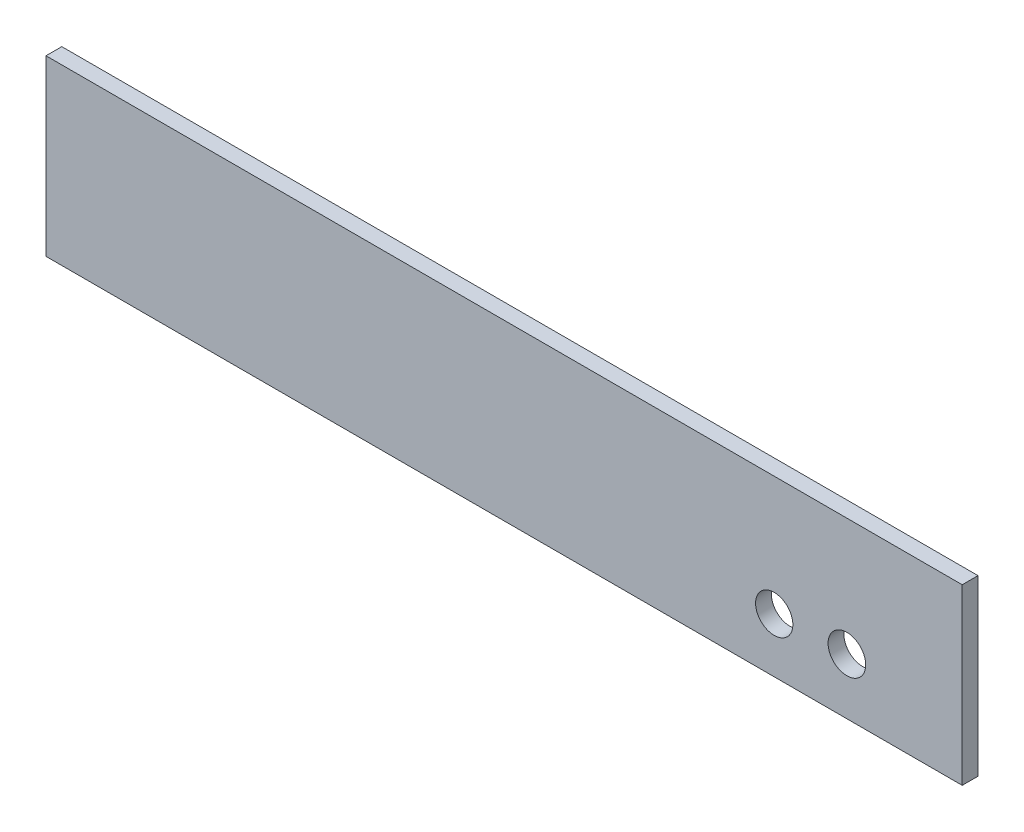
ISO-10303-21;
HEADER;
FILE_DESCRIPTION(('STEP AP214'),'2;1');
FILE_NAME('part.step','',(''),(''),'','','');
FILE_SCHEMA(('AUTOMOTIVE_DESIGN { 1 0 10303 214 1 1 1 1 }'));
ENDSEC;
DATA;
#1=APPLICATION_CONTEXT('core data for automotive mechanical design processes');
#2=APPLICATION_PROTOCOL_DEFINITION('international standard','automotive_design',2000,#1);
#3=PRODUCT_CONTEXT('',#1,'mechanical');
#4=PRODUCT('Part','Part','',(#3));
#5=PRODUCT_RELATED_PRODUCT_CATEGORY('part','',(#4));
#6=PRODUCT_DEFINITION_FORMATION('','',#4);
#7=PRODUCT_DEFINITION_CONTEXT('part definition',#1,'design');
#8=PRODUCT_DEFINITION('design','',#6,#7);
#9=PRODUCT_DEFINITION_SHAPE('','',#8);
#10=(LENGTH_UNIT() NAMED_UNIT(*) SI_UNIT(.MILLI.,.METRE.));
#11=(NAMED_UNIT(*) PLANE_ANGLE_UNIT() SI_UNIT($,.RADIAN.));
#12=(NAMED_UNIT(*) SI_UNIT($,.STERADIAN.) SOLID_ANGLE_UNIT());
#13=UNCERTAINTY_MEASURE_WITH_UNIT(LENGTH_MEASURE(1.E-05),#10,'distance_accuracy_value','');
#14=(GEOMETRIC_REPRESENTATION_CONTEXT(3) GLOBAL_UNCERTAINTY_ASSIGNED_CONTEXT((#13)) GLOBAL_UNIT_ASSIGNED_CONTEXT((#10,
#11,#12)) REPRESENTATION_CONTEXT('',''));
#15=CARTESIAN_POINT('',(0.,0.,0.));
#16=DIRECTION('',(0.,0.,1.));
#17=DIRECTION('',(1.,0.,0.));
#18=AXIS2_PLACEMENT_3D('',#15,#16,#17);
#19=CARTESIAN_POINT('',(0.,0.,10.));
#20=DIRECTION('',(1.,0.,0.));
#21=DIRECTION('',(0.,0.,-1.));
#22=AXIS2_PLACEMENT_3D('',#19,#20,#21);
#23=PLANE('',#22);
#24=DIRECTION('',(0.,-1.,0.));
#25=VECTOR('',#24,1.);
#26=CARTESIAN_POINT('',(0.,0.,0.));
#27=LINE('',#26,#25);
#28=CARTESIAN_POINT('',(0.,110.,0.));
#29=VERTEX_POINT('',#28);
#30=CARTESIAN_POINT('',(0.,0.,0.));
#31=VERTEX_POINT('',#30);
#32=EDGE_CURVE('E96',#29,#31,#27,.T.);
#33=ORIENTED_EDGE('',*,*,#32,.T.);
#34=DIRECTION('',(0.,0.,-1.));
#35=VECTOR('',#34,1.);
#36=CARTESIAN_POINT('',(0.,0.,10.));
#37=LINE('',#36,#35);
#38=CARTESIAN_POINT('',(0.,0.,10.));
#39=VERTEX_POINT('',#38);
#40=EDGE_CURVE('E11',#39,#31,#37,.T.);
#41=ORIENTED_EDGE('',*,*,#40,.F.);
#42=DIRECTION('',(0.,-1.,0.));
#43=VECTOR('',#42,1.);
#44=CARTESIAN_POINT('',(0.,0.,10.));
#45=LINE('',#44,#43);
#46=CARTESIAN_POINT('',(0.,110.,10.));
#47=VERTEX_POINT('',#46);
#48=EDGE_CURVE('E84',#47,#39,#45,.T.);
#49=ORIENTED_EDGE('',*,*,#48,.F.);
#50=DIRECTION('',(0.,0.,-1.));
#51=VECTOR('',#50,1.);
#52=CARTESIAN_POINT('',(0.,110.,10.));
#53=LINE('',#52,#51);
#54=EDGE_CURVE('E92',#47,#29,#53,.T.);
#55=ORIENTED_EDGE('',*,*,#54,.T.);
#56=EDGE_LOOP('',(#33,#41,#49,#55));
#57=FACE_BOUND('',#56,.T.);
#58=ADVANCED_FACE('F33',(#57),#23,.F.);
#59=CARTESIAN_POINT('',(0.,0.,10.));
#60=DIRECTION('',(0.,1.,0.));
#61=DIRECTION('',(0.,0.,1.));
#62=AXIS2_PLACEMENT_3D('',#59,#60,#61);
#63=PLANE('',#62);
#64=DIRECTION('',(1.,0.,0.));
#65=VECTOR('',#64,1.);
#66=CARTESIAN_POINT('',(0.,0.,0.));
#67=LINE('',#66,#65);
#68=CARTESIAN_POINT('',(580.,0.,0.));
#69=VERTEX_POINT('',#68);
#70=EDGE_CURVE('E88',#31,#69,#67,.T.);
#71=ORIENTED_EDGE('',*,*,#70,.T.);
#72=DIRECTION('',(0.,0.,-1.));
#73=VECTOR('',#72,1.);
#74=CARTESIAN_POINT('',(580.,0.,10.));
#75=LINE('',#74,#73);
#76=CARTESIAN_POINT('',(580.,0.,10.));
#77=VERTEX_POINT('',#76);
#78=EDGE_CURVE('E41',#77,#69,#75,.T.);
#79=ORIENTED_EDGE('',*,*,#78,.F.);
#80=DIRECTION('',(1.,0.,0.));
#81=VECTOR('',#80,1.);
#82=CARTESIAN_POINT('',(0.,0.,10.));
#83=LINE('',#82,#81);
#84=EDGE_CURVE('E79',#39,#77,#83,.T.);
#85=ORIENTED_EDGE('',*,*,#84,.F.);
#86=ORIENTED_EDGE('',*,*,#40,.T.);
#87=EDGE_LOOP('',(#71,#79,#85,#86));
#88=FACE_BOUND('',#87,.T.);
#89=ADVANCED_FACE('F87',(#88),#63,.F.);
#90=CARTESIAN_POINT('',(580.,0.,10.));
#91=DIRECTION('',(-1.,0.,0.));
#92=DIRECTION('',(0.,0.,1.));
#93=AXIS2_PLACEMENT_3D('',#90,#91,#92);
#94=PLANE('',#93);
#95=DIRECTION('',(0.,1.,0.));
#96=VECTOR('',#95,1.);
#97=CARTESIAN_POINT('',(580.,0.,0.));
#98=LINE('',#97,#96);
#99=CARTESIAN_POINT('',(580.,110.,0.));
#100=VERTEX_POINT('',#99);
#101=EDGE_CURVE('E66',#69,#100,#98,.T.);
#102=ORIENTED_EDGE('',*,*,#101,.T.);
#103=DIRECTION('',(0.,0.,-1.));
#104=VECTOR('',#103,1.);
#105=CARTESIAN_POINT('',(580.,110.,10.));
#106=LINE('',#105,#104);
#107=CARTESIAN_POINT('',(580.,110.,10.));
#108=VERTEX_POINT('',#107);
#109=EDGE_CURVE('E89',#108,#100,#106,.T.);
#110=ORIENTED_EDGE('',*,*,#109,.F.);
#111=DIRECTION('',(0.,1.,0.));
#112=VECTOR('',#111,1.);
#113=CARTESIAN_POINT('',(580.,0.,10.));
#114=LINE('',#113,#112);
#115=EDGE_CURVE('E82',#77,#108,#114,.T.);
#116=ORIENTED_EDGE('',*,*,#115,.F.);
#117=ORIENTED_EDGE('',*,*,#78,.T.);
#118=EDGE_LOOP('',(#102,#110,#116,#117));
#119=FACE_BOUND('',#118,.T.);
#120=ADVANCED_FACE('F90',(#119),#94,.F.);
#121=CARTESIAN_POINT('',(0.,110.,10.));
#122=DIRECTION('',(0.,-1.,0.));
#123=DIRECTION('',(0.,0.,-1.));
#124=AXIS2_PLACEMENT_3D('',#121,#122,#123);
#125=PLANE('',#124);
#126=DIRECTION('',(-1.,0.,0.));
#127=VECTOR('',#126,1.);
#128=CARTESIAN_POINT('',(0.,110.,0.));
#129=LINE('',#128,#127);
#130=EDGE_CURVE('E72',#100,#29,#129,.T.);
#131=ORIENTED_EDGE('',*,*,#130,.T.);
#132=ORIENTED_EDGE('',*,*,#54,.F.);
#133=DIRECTION('',(-1.,0.,0.));
#134=VECTOR('',#133,1.);
#135=CARTESIAN_POINT('',(0.,110.,10.));
#136=LINE('',#135,#134);
#137=EDGE_CURVE('E49',#108,#47,#136,.T.);
#138=ORIENTED_EDGE('',*,*,#137,.F.);
#139=ORIENTED_EDGE('',*,*,#109,.T.);
#140=EDGE_LOOP('',(#131,#132,#138,#139));
#141=FACE_BOUND('',#140,.T.);
#142=ADVANCED_FACE('F104',(#141),#125,.F.);
#143=CARTESIAN_POINT('',(0.,0.,10.));
#144=DIRECTION('',(0.,0.,-1.));
#145=DIRECTION('',(-1.,0.,0.));
#146=AXIS2_PLACEMENT_3D('',#143,#144,#145);
#147=PLANE('',#146);
#148=CARTESIAN_POINT('',(461.,34.5000000000001,10.));
#149=DIRECTION('',(0.,0.,-1.));
#150=DIRECTION('',(-1.,0.,0.));
#151=AXIS2_PLACEMENT_3D('',#148,#149,#150);
#152=CIRCLE('',#151,11.8);
#153=CARTESIAN_POINT('',(449.2,34.5000000000001,10.));
#154=VERTEX_POINT('',#153);
#155=EDGE_CURVE('E113',#154,#154,#152,.T.);
#156=ORIENTED_EDGE('',*,*,#155,.T.);
#157=EDGE_LOOP('',(#156));
#158=FACE_BOUND('',#157,.T.);
#159=CARTESIAN_POINT('',(507.,35.5000000000001,10.));
#160=DIRECTION('',(0.,0.,-1.));
#161=DIRECTION('',(-1.,0.,0.));
#162=AXIS2_PLACEMENT_3D('',#159,#160,#161);
#163=CIRCLE('',#162,11.9);
#164=CARTESIAN_POINT('',(495.1,35.5000000000001,10.));
#165=VERTEX_POINT('',#164);
#166=EDGE_CURVE('E99',#165,#165,#163,.T.);
#167=ORIENTED_EDGE('',*,*,#166,.T.);
#168=EDGE_LOOP('',(#167));
#169=FACE_BOUND('',#168,.T.);
#170=ORIENTED_EDGE('',*,*,#48,.T.);
#171=ORIENTED_EDGE('',*,*,#84,.T.);
#172=ORIENTED_EDGE('',*,*,#115,.T.);
#173=ORIENTED_EDGE('',*,*,#137,.T.);
#174=EDGE_LOOP('',(#170,#171,#172,#173));
#175=FACE_BOUND('',#174,.T.);
#176=ADVANCED_FACE('F80',(#158,#169,#175),#147,.F.);
#177=CARTESIAN_POINT('',(0.,0.,0.));
#178=DIRECTION('',(0.,0.,-1.));
#179=DIRECTION('',(-1.,0.,0.));
#180=AXIS2_PLACEMENT_3D('',#177,#178,#179);
#181=PLANE('',#180);
#182=CARTESIAN_POINT('',(461.,34.5000000000001,0.));
#183=DIRECTION('',(0.,0.,-1.));
#184=DIRECTION('',(-1.,0.,0.));
#185=AXIS2_PLACEMENT_3D('',#182,#183,#184);
#186=CIRCLE('',#185,11.8);
#187=CARTESIAN_POINT('',(449.2,34.5000000000001,0.));
#188=VERTEX_POINT('',#187);
#189=EDGE_CURVE('E116',#188,#188,#186,.T.);
#190=ORIENTED_EDGE('',*,*,#189,.F.);
#191=EDGE_LOOP('',(#190));
#192=FACE_BOUND('',#191,.T.);
#193=CARTESIAN_POINT('',(507.,35.5000000000001,0.));
#194=DIRECTION('',(0.,0.,-1.));
#195=DIRECTION('',(-1.,0.,0.));
#196=AXIS2_PLACEMENT_3D('',#193,#194,#195);
#197=CIRCLE('',#196,11.9);
#198=CARTESIAN_POINT('',(495.1,35.5000000000001,0.));
#199=VERTEX_POINT('',#198);
#200=EDGE_CURVE('E110',#199,#199,#197,.T.);
#201=ORIENTED_EDGE('',*,*,#200,.F.);
#202=EDGE_LOOP('',(#201));
#203=FACE_BOUND('',#202,.T.);
#204=ORIENTED_EDGE('',*,*,#32,.F.);
#205=ORIENTED_EDGE('',*,*,#130,.F.);
#206=ORIENTED_EDGE('',*,*,#101,.F.);
#207=ORIENTED_EDGE('',*,*,#70,.F.);
#208=EDGE_LOOP('',(#204,#205,#206,#207));
#209=FACE_BOUND('',#208,.T.);
#210=ADVANCED_FACE('F107',(#192,#203,#209),#181,.T.);
#211=CARTESIAN_POINT('',(507.,35.5000000000001,10.));
#212=DIRECTION('',(0.,0.,-1.));
#213=DIRECTION('',(-1.,0.,0.));
#214=AXIS2_PLACEMENT_3D('',#211,#212,#213);
#215=CYLINDRICAL_SURFACE('',#214,11.9);
#216=ORIENTED_EDGE('',*,*,#166,.F.);
#217=EDGE_LOOP('',(#216));
#218=FACE_BOUND('',#217,.T.);
#219=ORIENTED_EDGE('',*,*,#200,.T.);
#220=EDGE_LOOP('',(#219));
#221=FACE_BOUND('',#220,.T.);
#222=ADVANCED_FACE('F127',(#218,#221),#215,.F.);
#223=CARTESIAN_POINT('',(461.,34.5000000000001,10.));
#224=DIRECTION('',(0.,0.,-1.));
#225=DIRECTION('',(-1.,0.,0.));
#226=AXIS2_PLACEMENT_3D('',#223,#224,#225);
#227=CYLINDRICAL_SURFACE('',#226,11.8);
#228=ORIENTED_EDGE('',*,*,#155,.F.);
#229=EDGE_LOOP('',(#228));
#230=FACE_BOUND('',#229,.T.);
#231=ORIENTED_EDGE('',*,*,#189,.T.);
#232=EDGE_LOOP('',(#231));
#233=FACE_BOUND('',#232,.T.);
#234=ADVANCED_FACE('F124',(#230,#233),#227,.F.);
#235=CLOSED_SHELL('',(#58,#89,#120,#142,#176,#210,#222,#234));
#236=MANIFOLD_SOLID_BREP('B2',#235);
#237=ADVANCED_BREP_SHAPE_REPRESENTATION('',(#18,#236),#14);
#238=SHAPE_DEFINITION_REPRESENTATION(#9,#237);
ENDSEC;
END-ISO-10303-21;
